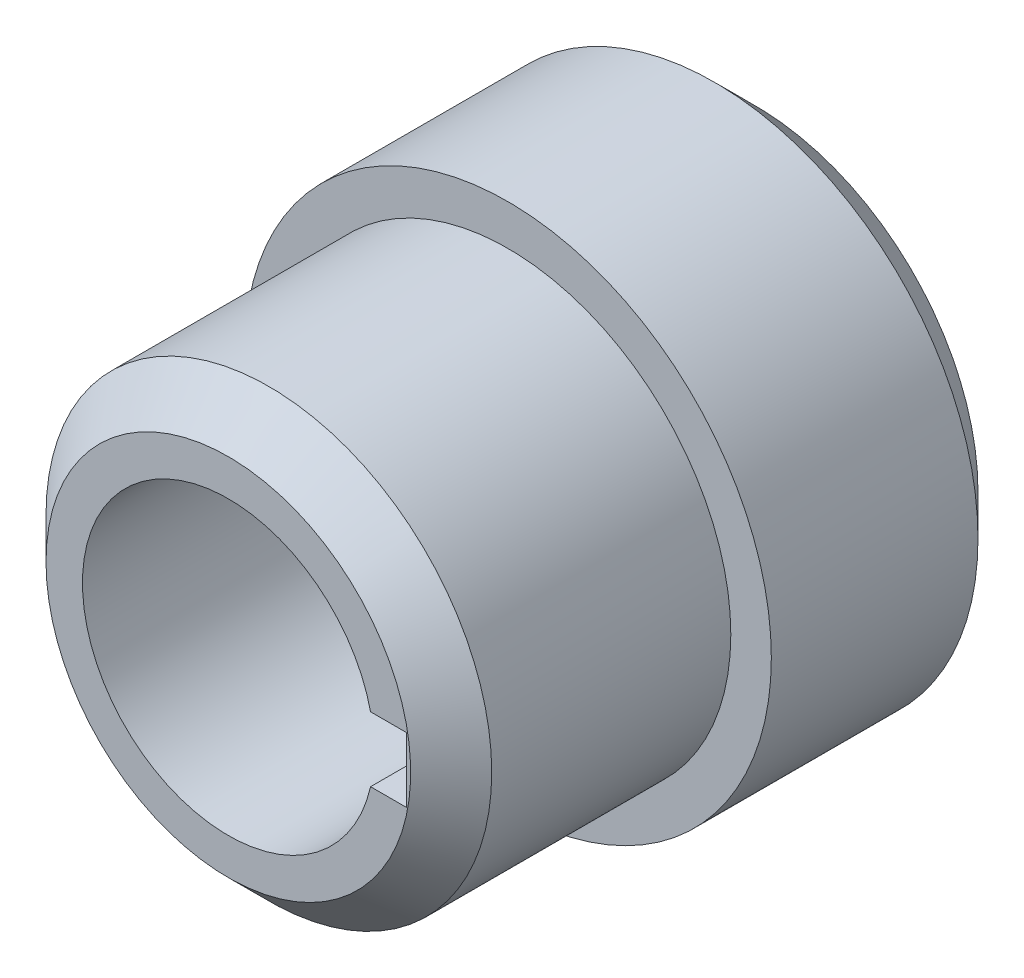
ISO-10303-21;
HEADER;
FILE_DESCRIPTION(('STEP AP214'),'2;1');
FILE_NAME('part.step','',(''),(''),'','','');
FILE_SCHEMA(('AUTOMOTIVE_DESIGN { 1 0 10303 214 1 1 1 1 }'));
ENDSEC;
DATA;
#1=APPLICATION_CONTEXT('core data for automotive mechanical design processes');
#2=APPLICATION_PROTOCOL_DEFINITION('international standard','automotive_design',2000,#1);
#3=PRODUCT_CONTEXT('',#1,'mechanical');
#4=PRODUCT('Part','Part','',(#3));
#5=PRODUCT_RELATED_PRODUCT_CATEGORY('part','',(#4));
#6=PRODUCT_DEFINITION_FORMATION('','',#4);
#7=PRODUCT_DEFINITION_CONTEXT('part definition',#1,'design');
#8=PRODUCT_DEFINITION('design','',#6,#7);
#9=PRODUCT_DEFINITION_SHAPE('','',#8);
#10=(LENGTH_UNIT() NAMED_UNIT(*) SI_UNIT(.MILLI.,.METRE.));
#11=(NAMED_UNIT(*) PLANE_ANGLE_UNIT() SI_UNIT($,.RADIAN.));
#12=(NAMED_UNIT(*) SI_UNIT($,.STERADIAN.) SOLID_ANGLE_UNIT());
#13=UNCERTAINTY_MEASURE_WITH_UNIT(LENGTH_MEASURE(1.E-05),#10,'distance_accuracy_value','');
#14=(GEOMETRIC_REPRESENTATION_CONTEXT(3) GLOBAL_UNCERTAINTY_ASSIGNED_CONTEXT((#13)) GLOBAL_UNIT_ASSIGNED_CONTEXT((#10,
#11,#12)) REPRESENTATION_CONTEXT('',''));
#15=CARTESIAN_POINT('',(0.,0.,0.));
#16=DIRECTION('',(0.,0.,1.));
#17=DIRECTION('',(1.,0.,0.));
#18=AXIS2_PLACEMENT_3D('',#15,#16,#17);
#19=CARTESIAN_POINT('',(0.,0.,25.5177245177772));
#20=DIRECTION('',(0.,0.,1.));
#21=DIRECTION('',(1.,0.,0.));
#22=AXIS2_PLACEMENT_3D('',#19,#20,#21);
#23=CYLINDRICAL_SURFACE('',#22,27.5);
#24=CARTESIAN_POINT('',(0.,0.,-5.00000000000003));
#25=DIRECTION('',(0.,0.,-1.));
#26=DIRECTION('',(-1.,0.,0.));
#27=AXIS2_PLACEMENT_3D('',#24,#25,#26);
#28=CIRCLE('',#27,27.5);
#29=CARTESIAN_POINT('',(-27.5,0.,-5.00000000000003));
#30=VERTEX_POINT('',#29);
#31=EDGE_CURVE('E116',#30,#30,#28,.T.);
#32=ORIENTED_EDGE('',*,*,#31,.T.);
#33=EDGE_LOOP('',(#32));
#34=FACE_BOUND('',#33,.T.);
#35=CARTESIAN_POINT('',(0.,0.,-34.5));
#36=DIRECTION('',(0.,0.,1.));
#37=DIRECTION('',(1.,0.,0.));
#38=AXIS2_PLACEMENT_3D('',#35,#36,#37);
#39=CIRCLE('',#38,27.5);
#40=CARTESIAN_POINT('',(27.5,0.,-34.5));
#41=VERTEX_POINT('',#40);
#42=EDGE_CURVE('E102',#41,#41,#39,.T.);
#43=ORIENTED_EDGE('',*,*,#42,.T.);
#44=EDGE_LOOP('',(#43));
#45=FACE_BOUND('',#44,.T.);
#46=ADVANCED_FACE('F35',(#34,#45),#23,.T.);
#47=CARTESIAN_POINT('',(0.,18.,0.));
#48=DIRECTION('',(0.,0.,-1.));
#49=DIRECTION('',(-1.,0.,0.));
#50=AXIS2_PLACEMENT_3D('',#47,#48,#49);
#51=PLANE('',#50);
#52=CARTESIAN_POINT('',(0.,0.,0.));
#53=DIRECTION('',(0.,0.,-1.));
#54=DIRECTION('',(-1.,0.,0.));
#55=AXIS2_PLACEMENT_3D('',#52,#53,#54);
#56=CIRCLE('',#55,22.5);
#57=CARTESIAN_POINT('',(-22.5,0.,0.));
#58=VERTEX_POINT('',#57);
#59=EDGE_CURVE('E113',#58,#58,#56,.F.);
#60=ORIENTED_EDGE('',*,*,#59,.T.);
#61=EDGE_LOOP('',(#60));
#62=FACE_BOUND('',#61,.T.);
#63=CARTESIAN_POINT('',(0.,0.,0.));
#64=DIRECTION('',(0.,0.,1.));
#65=DIRECTION('',(1.,0.,0.));
#66=AXIS2_PLACEMENT_3D('',#63,#64,#65);
#67=CIRCLE('',#66,18.);
#68=CARTESIAN_POINT('',(17.5499287747842,4.,0.));
#69=VERTEX_POINT('',#68);
#70=CARTESIAN_POINT('',(17.5499287747842,-4.,0.));
#71=VERTEX_POINT('',#70);
#72=EDGE_CURVE('E110',#69,#71,#67,.T.);
#73=ORIENTED_EDGE('',*,*,#72,.F.);
#74=DIRECTION('',(-1.,0.,0.));
#75=VECTOR('',#74,1.);
#76=CARTESIAN_POINT('',(14.,4.,0.));
#77=LINE('',#76,#75);
#78=CARTESIAN_POINT('',(22.,4.,0.));
#79=VERTEX_POINT('',#78);
#80=EDGE_CURVE('E91',#79,#69,#77,.T.);
#81=ORIENTED_EDGE('',*,*,#80,.F.);
#82=DIRECTION('',(0.,1.,0.));
#83=VECTOR('',#82,1.);
#84=CARTESIAN_POINT('',(22.,4.,0.));
#85=LINE('',#84,#83);
#86=CARTESIAN_POINT('',(22.,-4.,0.));
#87=VERTEX_POINT('',#86);
#88=EDGE_CURVE('E79',#87,#79,#85,.T.);
#89=ORIENTED_EDGE('',*,*,#88,.F.);
#90=DIRECTION('',(1.,0.,0.));
#91=VECTOR('',#90,1.);
#92=CARTESIAN_POINT('',(14.,-4.,0.));
#93=LINE('',#92,#91);
#94=EDGE_CURVE('E95',#71,#87,#93,.T.);
#95=ORIENTED_EDGE('',*,*,#94,.F.);
#96=EDGE_LOOP('',(#73,#81,#89,#95));
#97=FACE_BOUND('',#96,.T.);
#98=ADVANCED_FACE('F147',(#62,#97),#51,.F.);
#99=CARTESIAN_POINT('',(0.,0.,25.5177245177772));
#100=DIRECTION('',(0.,0.,1.));
#101=DIRECTION('',(1.,0.,0.));
#102=AXIS2_PLACEMENT_3D('',#99,#100,#101);
#103=CYLINDRICAL_SURFACE('',#102,18.);
#104=CARTESIAN_POINT('',(0.,0.,-65.));
#105=DIRECTION('',(0.,0.,1.));
#106=DIRECTION('',(1.,0.,0.));
#107=AXIS2_PLACEMENT_3D('',#104,#105,#106);
#108=CIRCLE('',#107,18.);
#109=CARTESIAN_POINT('',(17.5499287747842,4.,-65.));
#110=VERTEX_POINT('',#109);
#111=CARTESIAN_POINT('',(17.5499287747842,-4.,-65.));
#112=VERTEX_POINT('',#111);
#113=EDGE_CURVE('E108',#110,#112,#108,.T.);
#114=ORIENTED_EDGE('',*,*,#113,.F.);
#115=DIRECTION('',(0.,0.,1.));
#116=VECTOR('',#115,1.);
#117=CARTESIAN_POINT('',(17.5499287747842,4.,25.5177245177772));
#118=LINE('',#117,#116);
#119=EDGE_CURVE('E58',#110,#69,#118,.T.);
#120=ORIENTED_EDGE('',*,*,#119,.T.);
#121=ORIENTED_EDGE('',*,*,#72,.T.);
#122=DIRECTION('',(0.,0.,1.));
#123=VECTOR('',#122,1.);
#124=CARTESIAN_POINT('',(17.5499287747842,-4.,25.5177245177772));
#125=LINE('',#124,#123);
#126=EDGE_CURVE('E81',#71,#112,#125,.F.);
#127=ORIENTED_EDGE('',*,*,#126,.T.);
#128=EDGE_LOOP('',(#114,#120,#121,#127));
#129=FACE_BOUND('',#128,.T.);
#130=ADVANCED_FACE('F153',(#129),#103,.F.);
#131=CARTESIAN_POINT('',(0.,32.5,-65.));
#132=DIRECTION('',(0.,0.,1.));
#133=DIRECTION('',(1.,0.,0.));
#134=AXIS2_PLACEMENT_3D('',#131,#132,#133);
#135=PLANE('',#134);
#136=CARTESIAN_POINT('',(0.,0.,-65.));
#137=DIRECTION('',(0.,0.,1.));
#138=DIRECTION('',(1.,0.,0.));
#139=AXIS2_PLACEMENT_3D('',#136,#137,#138);
#140=CIRCLE('',#139,27.5);
#141=CARTESIAN_POINT('',(27.5,0.,-65.));
#142=VERTEX_POINT('',#141);
#143=EDGE_CURVE('E43',#142,#142,#140,.F.);
#144=ORIENTED_EDGE('',*,*,#143,.T.);
#145=EDGE_LOOP('',(#144));
#146=FACE_BOUND('',#145,.T.);
#147=DIRECTION('',(0.,1.,0.));
#148=VECTOR('',#147,1.);
#149=CARTESIAN_POINT('',(22.,4.,-65.));
#150=LINE('',#149,#148);
#151=CARTESIAN_POINT('',(22.,-4.,-65.));
#152=VERTEX_POINT('',#151);
#153=CARTESIAN_POINT('',(22.,4.,-65.));
#154=VERTEX_POINT('',#153);
#155=EDGE_CURVE('E50',#152,#154,#150,.T.);
#156=ORIENTED_EDGE('',*,*,#155,.T.);
#157=DIRECTION('',(-1.,0.,0.));
#158=VECTOR('',#157,1.);
#159=CARTESIAN_POINT('',(14.,4.,-65.));
#160=LINE('',#159,#158);
#161=EDGE_CURVE('E84',#154,#110,#160,.T.);
#162=ORIENTED_EDGE('',*,*,#161,.T.);
#163=ORIENTED_EDGE('',*,*,#113,.T.);
#164=DIRECTION('',(1.,0.,0.));
#165=VECTOR('',#164,1.);
#166=CARTESIAN_POINT('',(0.,-4.,-65.));
#167=LINE('',#166,#165);
#168=EDGE_CURVE('E11',#112,#152,#167,.T.);
#169=ORIENTED_EDGE('',*,*,#168,.T.);
#170=EDGE_LOOP('',(#156,#162,#163,#169));
#171=FACE_BOUND('',#170,.T.);
#172=ADVANCED_FACE('F90',(#146,#171),#135,.F.);
#173=CARTESIAN_POINT('',(0.,0.,25.5177245177772));
#174=DIRECTION('',(0.,0.,1.));
#175=DIRECTION('',(1.,0.,0.));
#176=AXIS2_PLACEMENT_3D('',#173,#174,#175);
#177=CYLINDRICAL_SURFACE('',#176,32.5);
#178=CARTESIAN_POINT('',(0.,0.,-60.));
#179=DIRECTION('',(0.,0.,1.));
#180=DIRECTION('',(1.,0.,0.));
#181=AXIS2_PLACEMENT_3D('',#178,#179,#180);
#182=CIRCLE('',#181,32.5);
#183=CARTESIAN_POINT('',(32.5,0.,-60.));
#184=VERTEX_POINT('',#183);
#185=EDGE_CURVE('E119',#184,#184,#182,.T.);
#186=ORIENTED_EDGE('',*,*,#185,.T.);
#187=EDGE_LOOP('',(#186));
#188=FACE_BOUND('',#187,.T.);
#189=CARTESIAN_POINT('',(0.,0.,-34.5));
#190=DIRECTION('',(0.,0.,1.));
#191=DIRECTION('',(1.,0.,0.));
#192=AXIS2_PLACEMENT_3D('',#189,#190,#191);
#193=CIRCLE('',#192,32.5);
#194=CARTESIAN_POINT('',(32.5,0.,-34.5));
#195=VERTEX_POINT('',#194);
#196=EDGE_CURVE('E105',#195,#195,#193,.T.);
#197=ORIENTED_EDGE('',*,*,#196,.F.);
#198=EDGE_LOOP('',(#197));
#199=FACE_BOUND('',#198,.T.);
#200=ADVANCED_FACE('F130',(#188,#199),#177,.T.);
#201=CARTESIAN_POINT('',(0.,27.5,-34.5));
#202=DIRECTION('',(0.,0.,-1.));
#203=DIRECTION('',(-1.,0.,0.));
#204=AXIS2_PLACEMENT_3D('',#201,#202,#203);
#205=PLANE('',#204);
#206=ORIENTED_EDGE('',*,*,#42,.F.);
#207=EDGE_LOOP('',(#206));
#208=FACE_BOUND('',#207,.T.);
#209=ORIENTED_EDGE('',*,*,#196,.T.);
#210=EDGE_LOOP('',(#209));
#211=FACE_BOUND('',#210,.T.);
#212=ADVANCED_FACE('F133',(#208,#211),#205,.F.);
#213=CARTESIAN_POINT('',(0.,0.,0.));
#214=DIRECTION('',(0.,0.,-1.));
#215=DIRECTION('',(-1.,0.,0.));
#216=AXIS2_PLACEMENT_3D('',#213,#214,#215);
#217=CONICAL_SURFACE('',#216,22.5,0.785398163397446);
#218=ORIENTED_EDGE('',*,*,#31,.F.);
#219=EDGE_LOOP('',(#218));
#220=FACE_BOUND('',#219,.T.);
#221=ORIENTED_EDGE('',*,*,#59,.F.);
#222=EDGE_LOOP('',(#221));
#223=FACE_BOUND('',#222,.T.);
#224=ADVANCED_FACE('F127',(#220,#223),#217,.T.);
#225=CARTESIAN_POINT('',(0.,0.,-60.));
#226=DIRECTION('',(0.,0.,1.));
#227=DIRECTION('',(1.,0.,0.));
#228=AXIS2_PLACEMENT_3D('',#225,#226,#227);
#229=CONICAL_SURFACE('',#228,32.5,0.785398163397449);
#230=ORIENTED_EDGE('',*,*,#143,.F.);
#231=EDGE_LOOP('',(#230));
#232=FACE_BOUND('',#231,.T.);
#233=ORIENTED_EDGE('',*,*,#185,.F.);
#234=EDGE_LOOP('',(#233));
#235=FACE_BOUND('',#234,.T.);
#236=ADVANCED_FACE('F37',(#232,#235),#229,.T.);
#237=CARTESIAN_POINT('',(14.,4.,-65.));
#238=DIRECTION('',(0.,1.,0.));
#239=DIRECTION('',(0.,0.,1.));
#240=AXIS2_PLACEMENT_3D('',#237,#238,#239);
#241=PLANE('',#240);
#242=ORIENTED_EDGE('',*,*,#161,.F.);
#243=DIRECTION('',(0.,0.,1.));
#244=VECTOR('',#243,1.);
#245=CARTESIAN_POINT('',(22.,4.,-65.));
#246=LINE('',#245,#244);
#247=EDGE_CURVE('E76',#154,#79,#246,.T.);
#248=ORIENTED_EDGE('',*,*,#247,.T.);
#249=ORIENTED_EDGE('',*,*,#80,.T.);
#250=ORIENTED_EDGE('',*,*,#119,.F.);
#251=EDGE_LOOP('',(#242,#248,#249,#250));
#252=FACE_BOUND('',#251,.T.);
#253=ADVANCED_FACE('F85',(#252),#241,.F.);
#254=CARTESIAN_POINT('',(14.,-4.,-65.));
#255=DIRECTION('',(0.,-1.,0.));
#256=DIRECTION('',(0.,0.,-1.));
#257=AXIS2_PLACEMENT_3D('',#254,#255,#256);
#258=PLANE('',#257);
#259=ORIENTED_EDGE('',*,*,#94,.T.);
#260=DIRECTION('',(0.,0.,1.));
#261=VECTOR('',#260,1.);
#262=CARTESIAN_POINT('',(22.,-4.,-65.));
#263=LINE('',#262,#261);
#264=EDGE_CURVE('E82',#152,#87,#263,.T.);
#265=ORIENTED_EDGE('',*,*,#264,.F.);
#266=ORIENTED_EDGE('',*,*,#168,.F.);
#267=ORIENTED_EDGE('',*,*,#126,.F.);
#268=EDGE_LOOP('',(#259,#265,#266,#267));
#269=FACE_BOUND('',#268,.T.);
#270=ADVANCED_FACE('F211',(#269),#258,.F.);
#271=CARTESIAN_POINT('',(22.,4.,-65.));
#272=DIRECTION('',(1.,0.,0.));
#273=DIRECTION('',(0.,0.,-1.));
#274=AXIS2_PLACEMENT_3D('',#271,#272,#273);
#275=PLANE('',#274);
#276=ORIENTED_EDGE('',*,*,#88,.T.);
#277=ORIENTED_EDGE('',*,*,#247,.F.);
#278=ORIENTED_EDGE('',*,*,#155,.F.);
#279=ORIENTED_EDGE('',*,*,#264,.T.);
#280=EDGE_LOOP('',(#276,#277,#278,#279));
#281=FACE_BOUND('',#280,.T.);
#282=ADVANCED_FACE('F77',(#281),#275,.F.);
#283=CLOSED_SHELL('',(#46,#98,#130,#172,#200,#212,#224,#236,#253,#270,#282));
#284=MANIFOLD_SOLID_BREP('B2',#283);
#285=ADVANCED_BREP_SHAPE_REPRESENTATION('',(#18,#284),#14);
#286=SHAPE_DEFINITION_REPRESENTATION(#9,#285);
ENDSEC;
END-ISO-10303-21;
